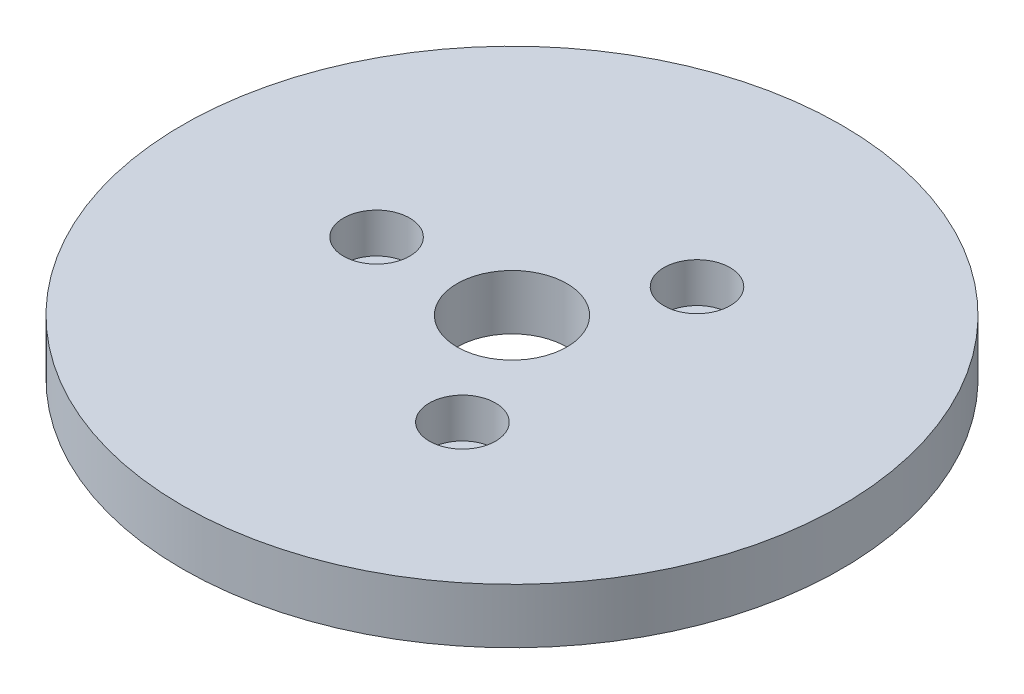
ISO-10303-21;
HEADER;
FILE_DESCRIPTION(('STEP AP214'),'2;1');
FILE_NAME('part.step','',(''),(''),'','','');
FILE_SCHEMA(('AUTOMOTIVE_DESIGN { 1 0 10303 214 1 1 1 1 }'));
ENDSEC;
DATA;
#1=APPLICATION_CONTEXT('core data for automotive mechanical design processes');
#2=APPLICATION_PROTOCOL_DEFINITION('international standard','automotive_design',2000,#1);
#3=PRODUCT_CONTEXT('',#1,'mechanical');
#4=PRODUCT('Part','Part','',(#3));
#5=PRODUCT_RELATED_PRODUCT_CATEGORY('part','',(#4));
#6=PRODUCT_DEFINITION_FORMATION('','',#4);
#7=PRODUCT_DEFINITION_CONTEXT('part definition',#1,'design');
#8=PRODUCT_DEFINITION('design','',#6,#7);
#9=PRODUCT_DEFINITION_SHAPE('','',#8);
#10=(LENGTH_UNIT() NAMED_UNIT(*) SI_UNIT(.MILLI.,.METRE.));
#11=(NAMED_UNIT(*) PLANE_ANGLE_UNIT() SI_UNIT($,.RADIAN.));
#12=(NAMED_UNIT(*) SI_UNIT($,.STERADIAN.) SOLID_ANGLE_UNIT());
#13=UNCERTAINTY_MEASURE_WITH_UNIT(LENGTH_MEASURE(1.E-05),#10,'distance_accuracy_value','');
#14=(GEOMETRIC_REPRESENTATION_CONTEXT(3) GLOBAL_UNCERTAINTY_ASSIGNED_CONTEXT((#13)) GLOBAL_UNIT_ASSIGNED_CONTEXT((#10,
#11,#12)) REPRESENTATION_CONTEXT('',''));
#15=CARTESIAN_POINT('',(0.,0.,0.));
#16=DIRECTION('',(0.,0.,1.));
#17=DIRECTION('',(1.,0.,0.));
#18=AXIS2_PLACEMENT_3D('',#15,#16,#17);
#19=CARTESIAN_POINT('',(0.,10.,0.));
#20=DIRECTION('',(0.,-1.,0.));
#21=DIRECTION('',(0.,0.,-1.));
#22=AXIS2_PLACEMENT_3D('',#19,#20,#21);
#23=CYLINDRICAL_SURFACE('',#22,60.);
#24=CARTESIAN_POINT('',(0.,10.,0.));
#25=DIRECTION('',(0.,1.,0.));
#26=DIRECTION('',(0.,0.,1.));
#27=AXIS2_PLACEMENT_3D('',#24,#25,#26);
#28=CIRCLE('',#27,60.);
#29=CARTESIAN_POINT('',(0.,10.,60.));
#30=VERTEX_POINT('',#29);
#31=EDGE_CURVE('E10',#30,#30,#28,.T.);
#32=ORIENTED_EDGE('',*,*,#31,.F.);
#33=EDGE_LOOP('',(#32));
#34=FACE_BOUND('',#33,.T.);
#35=CARTESIAN_POINT('',(0.,0.,0.));
#36=DIRECTION('',(0.,1.,0.));
#37=DIRECTION('',(0.,0.,1.));
#38=AXIS2_PLACEMENT_3D('',#35,#36,#37);
#39=CIRCLE('',#38,60.);
#40=CARTESIAN_POINT('',(0.,0.,60.));
#41=VERTEX_POINT('',#40);
#42=EDGE_CURVE('E37',#41,#41,#39,.T.);
#43=ORIENTED_EDGE('',*,*,#42,.T.);
#44=EDGE_LOOP('',(#43));
#45=FACE_BOUND('',#44,.T.);
#46=ADVANCED_FACE('F40',(#34,#45),#23,.T.);
#47=CARTESIAN_POINT('',(0.,10.,0.));
#48=DIRECTION('',(0.,1.,0.));
#49=DIRECTION('',(0.,0.,1.));
#50=AXIS2_PLACEMENT_3D('',#47,#48,#49);
#51=PLANE('',#50);
#52=CARTESIAN_POINT('',(12.3275861518122,10.,21.3520055496209));
#53=DIRECTION('',(0.,1.,0.));
#54=DIRECTION('',(0.866025403784436,0.,-0.500000000000004));
#55=AXIS2_PLACEMENT_3D('',#52,#53,#54);
#56=CIRCLE('',#55,6.02700764693854);
#57=CARTESIAN_POINT('',(17.547127882864,10.,18.3385017261517));
#58=VERTEX_POINT('',#57);
#59=EDGE_CURVE('E70',#58,#58,#56,.T.);
#60=ORIENTED_EDGE('',*,*,#59,.F.);
#61=EDGE_LOOP('',(#60));
#62=FACE_BOUND('',#61,.T.);
#63=CARTESIAN_POINT('',(12.3275861518119,10.,-21.3520055496211));
#64=DIRECTION('',(0.,1.,0.));
#65=DIRECTION('',(-0.866025403784443,0.,-0.499999999999992));
#66=AXIS2_PLACEMENT_3D('',#63,#64,#65);
#67=CIRCLE('',#66,6.02700764693854);
#68=CARTESIAN_POINT('',(7.10804442076,10.,-24.3655093730903));
#69=VERTEX_POINT('',#68);
#70=EDGE_CURVE('E61',#69,#69,#67,.T.);
#71=ORIENTED_EDGE('',*,*,#70,.F.);
#72=EDGE_LOOP('',(#71));
#73=FACE_BOUND('',#72,.T.);
#74=CARTESIAN_POINT('',(-24.6551723036241,10.,0.));
#75=DIRECTION('',(0.,1.,0.));
#76=DIRECTION('',(0.,0.,1.));
#77=AXIS2_PLACEMENT_3D('',#74,#75,#76);
#78=CIRCLE('',#77,6.02700764693854);
#79=CARTESIAN_POINT('',(-24.6551723036241,10.,6.02700764693854));
#80=VERTEX_POINT('',#79);
#81=EDGE_CURVE('E54',#80,#80,#78,.T.);
#82=ORIENTED_EDGE('',*,*,#81,.F.);
#83=EDGE_LOOP('',(#82));
#84=FACE_BOUND('',#83,.T.);
#85=CARTESIAN_POINT('',(0.,10.,0.));
#86=DIRECTION('',(0.,1.,0.));
#87=DIRECTION('',(0.,0.,1.));
#88=AXIS2_PLACEMENT_3D('',#85,#86,#87);
#89=CIRCLE('',#88,10.);
#90=CARTESIAN_POINT('',(0.,10.,10.));
#91=VERTEX_POINT('',#90);
#92=EDGE_CURVE('E50',#91,#91,#89,.T.);
#93=ORIENTED_EDGE('',*,*,#92,.F.);
#94=EDGE_LOOP('',(#93));
#95=FACE_BOUND('',#94,.T.);
#96=ORIENTED_EDGE('',*,*,#31,.T.);
#97=EDGE_LOOP('',(#96));
#98=FACE_BOUND('',#97,.T.);
#99=ADVANCED_FACE('F85',(#62,#73,#84,#95,#98),#51,.T.);
#100=CARTESIAN_POINT('',(0.,0.,0.));
#101=DIRECTION('',(0.,1.,0.));
#102=DIRECTION('',(0.,0.,1.));
#103=AXIS2_PLACEMENT_3D('',#100,#101,#102);
#104=PLANE('',#103);
#105=CARTESIAN_POINT('',(0.,0.,0.));
#106=DIRECTION('',(0.,1.,0.));
#107=DIRECTION('',(0.,0.,1.));
#108=AXIS2_PLACEMENT_3D('',#105,#106,#107);
#109=CIRCLE('',#108,10.);
#110=CARTESIAN_POINT('',(0.,0.,10.));
#111=VERTEX_POINT('',#110);
#112=EDGE_CURVE('E47',#111,#111,#109,.T.);
#113=ORIENTED_EDGE('',*,*,#112,.T.);
#114=EDGE_LOOP('',(#113));
#115=FACE_BOUND('',#114,.T.);
#116=ORIENTED_EDGE('',*,*,#42,.F.);
#117=EDGE_LOOP('',(#116));
#118=FACE_BOUND('',#117,.T.);
#119=ADVANCED_FACE('F84',(#115,#118),#104,.F.);
#120=CARTESIAN_POINT('',(0.,10.,0.));
#121=DIRECTION('',(0.,-1.,0.));
#122=DIRECTION('',(0.,0.,-1.));
#123=AXIS2_PLACEMENT_3D('',#120,#121,#122);
#124=CYLINDRICAL_SURFACE('',#123,10.);
#125=ORIENTED_EDGE('',*,*,#92,.T.);
#126=EDGE_LOOP('',(#125));
#127=FACE_BOUND('',#126,.T.);
#128=ORIENTED_EDGE('',*,*,#112,.F.);
#129=EDGE_LOOP('',(#128));
#130=FACE_BOUND('',#129,.T.);
#131=ADVANCED_FACE('F91',(#127,#130),#124,.F.);
#132=CARTESIAN_POINT('',(-24.6551723036241,2.76045011982416,0.));
#133=DIRECTION('',(0.,1.,0.));
#134=DIRECTION('',(0.,0.,1.));
#135=AXIS2_PLACEMENT_3D('',#132,#133,#134);
#136=CYLINDRICAL_SURFACE('',#135,6.02700764693854);
#137=CARTESIAN_POINT('',(-24.6551723036241,2.76045011982416,0.));
#138=DIRECTION('',(0.,1.,0.));
#139=DIRECTION('',(0.,0.,1.));
#140=AXIS2_PLACEMENT_3D('',#137,#138,#139);
#141=CIRCLE('',#140,6.02700764693854);
#142=CARTESIAN_POINT('',(-24.6551723036241,2.76045011982416,6.02700764693854));
#143=VERTEX_POINT('',#142);
#144=EDGE_CURVE('E55',#143,#143,#141,.T.);
#145=ORIENTED_EDGE('',*,*,#144,.F.);
#146=EDGE_LOOP('',(#145));
#147=FACE_BOUND('',#146,.T.);
#148=ORIENTED_EDGE('',*,*,#81,.T.);
#149=EDGE_LOOP('',(#148));
#150=FACE_BOUND('',#149,.T.);
#151=ADVANCED_FACE('F96',(#147,#150),#136,.F.);
#152=CARTESIAN_POINT('',(-24.6551723036241,2.76045011982416,0.));
#153=DIRECTION('',(0.,1.,0.));
#154=DIRECTION('',(0.,0.,1.));
#155=AXIS2_PLACEMENT_3D('',#152,#153,#154);
#156=PLANE('',#155);
#157=ORIENTED_EDGE('',*,*,#144,.T.);
#158=EDGE_LOOP('',(#157));
#159=FACE_BOUND('',#158,.T.);
#160=ADVANCED_FACE('F127',(#159),#156,.T.);
#161=CARTESIAN_POINT('',(12.3275861518119,2.76045011982416,-21.3520055496211));
#162=DIRECTION('',(0.,1.,0.));
#163=DIRECTION('',(0.,0.,1.));
#164=AXIS2_PLACEMENT_3D('',#161,#162,#163);
#165=CYLINDRICAL_SURFACE('',#164,6.02700764693854);
#166=CARTESIAN_POINT('',(12.3275861518119,2.76045011982416,-21.3520055496211));
#167=DIRECTION('',(0.,1.,0.));
#168=DIRECTION('',(-0.866025403784443,0.,-0.499999999999992));
#169=AXIS2_PLACEMENT_3D('',#166,#167,#168);
#170=CIRCLE('',#169,6.02700764693854);
#171=CARTESIAN_POINT('',(7.10804442076,2.76045011982416,-24.3655093730903));
#172=VERTEX_POINT('',#171);
#173=EDGE_CURVE('E63',#172,#172,#170,.T.);
#174=ORIENTED_EDGE('',*,*,#173,.F.);
#175=EDGE_LOOP('',(#174));
#176=FACE_BOUND('',#175,.T.);
#177=ORIENTED_EDGE('',*,*,#70,.T.);
#178=EDGE_LOOP('',(#177));
#179=FACE_BOUND('',#178,.T.);
#180=ADVANCED_FACE('F133',(#176,#179),#165,.F.);
#181=CARTESIAN_POINT('',(12.3275861518119,2.76045011982416,-21.3520055496211));
#182=DIRECTION('',(0.,1.,0.));
#183=DIRECTION('',(-0.866025403784443,0.,-0.499999999999992));
#184=AXIS2_PLACEMENT_3D('',#181,#182,#183);
#185=PLANE('',#184);
#186=ORIENTED_EDGE('',*,*,#173,.T.);
#187=EDGE_LOOP('',(#186));
#188=FACE_BOUND('',#187,.T.);
#189=ADVANCED_FACE('F77',(#188),#185,.T.);
#190=CARTESIAN_POINT('',(12.3275861518122,2.76045011982416,21.3520055496209));
#191=DIRECTION('',(0.,1.,0.));
#192=DIRECTION('',(0.,0.,1.));
#193=AXIS2_PLACEMENT_3D('',#190,#191,#192);
#194=CYLINDRICAL_SURFACE('',#193,6.02700764693854);
#195=CARTESIAN_POINT('',(12.3275861518122,2.76045011982416,21.3520055496209));
#196=DIRECTION('',(0.,1.,0.));
#197=DIRECTION('',(0.866025403784436,0.,-0.500000000000004));
#198=AXIS2_PLACEMENT_3D('',#195,#196,#197);
#199=CIRCLE('',#198,6.02700764693854);
#200=CARTESIAN_POINT('',(17.547127882864,2.76045011982416,18.3385017261517));
#201=VERTEX_POINT('',#200);
#202=EDGE_CURVE('E59',#201,#201,#199,.T.);
#203=ORIENTED_EDGE('',*,*,#202,.F.);
#204=EDGE_LOOP('',(#203));
#205=FACE_BOUND('',#204,.T.);
#206=ORIENTED_EDGE('',*,*,#59,.T.);
#207=EDGE_LOOP('',(#206));
#208=FACE_BOUND('',#207,.T.);
#209=ADVANCED_FACE('F73',(#205,#208),#194,.F.);
#210=CARTESIAN_POINT('',(12.3275861518122,2.76045011982416,21.3520055496209));
#211=DIRECTION('',(0.,1.,0.));
#212=DIRECTION('',(0.866025403784436,0.,-0.500000000000004));
#213=AXIS2_PLACEMENT_3D('',#210,#211,#212);
#214=PLANE('',#213);
#215=ORIENTED_EDGE('',*,*,#202,.T.);
#216=EDGE_LOOP('',(#215));
#217=FACE_BOUND('',#216,.T.);
#218=ADVANCED_FACE('F71',(#217),#214,.T.);
#219=CLOSED_SHELL('',(#46,#99,#119,#131,#151,#160,#180,#189,#209,#218));
#220=MANIFOLD_SOLID_BREP('B2',#219);
#221=ADVANCED_BREP_SHAPE_REPRESENTATION('',(#18,#220),#14);
#222=SHAPE_DEFINITION_REPRESENTATION(#9,#221);
ENDSEC;
END-ISO-10303-21;
